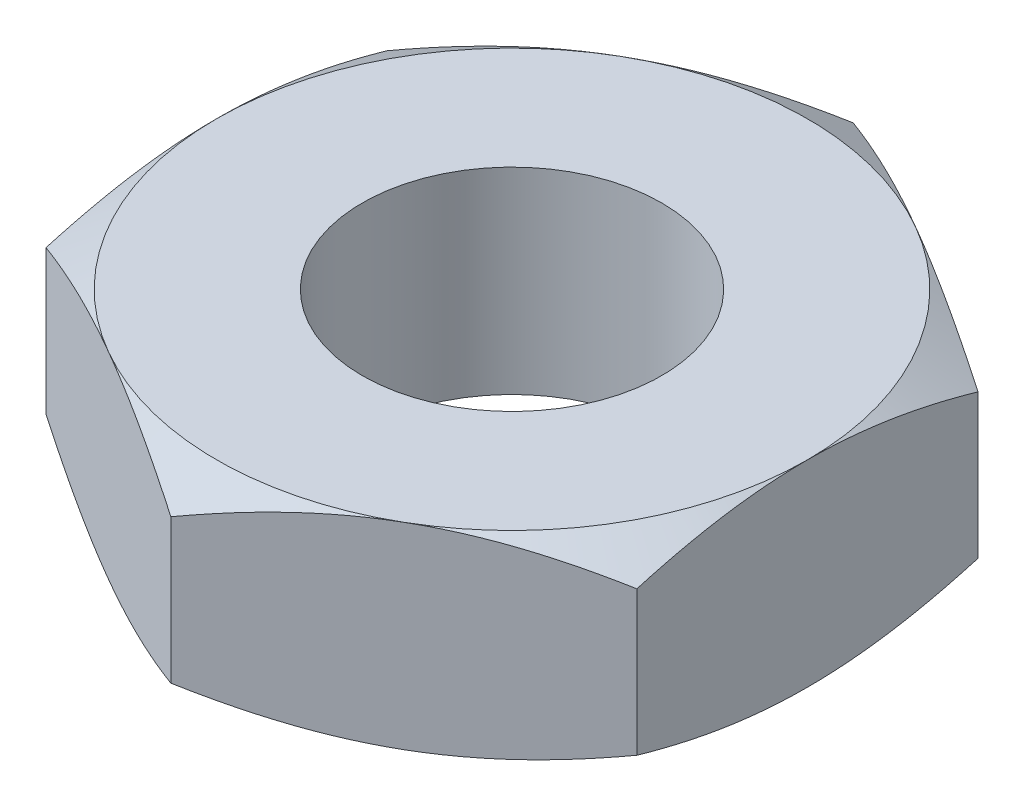
ISO-10303-21;
HEADER;
FILE_DESCRIPTION(('STEP AP214'),'2;1');
FILE_NAME('part.step','',(''),(''),'','','');
FILE_SCHEMA(('AUTOMOTIVE_DESIGN { 1 0 10303 214 1 1 1 1 }'));
ENDSEC;
DATA;
#1=APPLICATION_CONTEXT('core data for automotive mechanical design processes');
#2=APPLICATION_PROTOCOL_DEFINITION('international standard','automotive_design',2000,#1);
#3=PRODUCT_CONTEXT('',#1,'mechanical');
#4=PRODUCT('Part','Part','',(#3));
#5=PRODUCT_RELATED_PRODUCT_CATEGORY('part','',(#4));
#6=PRODUCT_DEFINITION_FORMATION('','',#4);
#7=PRODUCT_DEFINITION_CONTEXT('part definition',#1,'design');
#8=PRODUCT_DEFINITION('design','',#6,#7);
#9=PRODUCT_DEFINITION_SHAPE('','',#8);
#10=(LENGTH_UNIT() NAMED_UNIT(*) SI_UNIT(.MILLI.,.METRE.));
#11=(NAMED_UNIT(*) PLANE_ANGLE_UNIT() SI_UNIT($,.RADIAN.));
#12=(NAMED_UNIT(*) SI_UNIT($,.STERADIAN.) SOLID_ANGLE_UNIT());
#13=UNCERTAINTY_MEASURE_WITH_UNIT(LENGTH_MEASURE(1.E-05),#10,'distance_accuracy_value','');
#14=(GEOMETRIC_REPRESENTATION_CONTEXT(3) GLOBAL_UNCERTAINTY_ASSIGNED_CONTEXT((#13)) GLOBAL_UNIT_ASSIGNED_CONTEXT((#10,
#11,#12)) REPRESENTATION_CONTEXT('',''));
#15=CARTESIAN_POINT('',(0.,0.,0.));
#16=DIRECTION('',(0.,0.,1.));
#17=DIRECTION('',(1.,0.,0.));
#18=AXIS2_PLACEMENT_3D('',#15,#16,#17);
#19=CARTESIAN_POINT('',(-4.7625,1.5875,-2.74963065701559));
#20=DIRECTION('',(0.,1.,0.));
#21=DIRECTION('',(0.,0.,1.));
#22=AXIS2_PLACEMENT_3D('',#19,#20,#21);
#23=PLANE('',#22);
#24=CARTESIAN_POINT('',(0.,1.5875,0.));
#25=DIRECTION('',(0.,1.,0.));
#26=DIRECTION('',(0.,0.,1.));
#27=AXIS2_PLACEMENT_3D('',#24,#25,#26);
#28=CIRCLE('',#27,2.413);
#29=CARTESIAN_POINT('',(0.,1.5875,2.413));
#30=VERTEX_POINT('',#29);
#31=EDGE_CURVE('E244',#30,#30,#28,.T.);
#32=ORIENTED_EDGE('',*,*,#31,.F.);
#33=EDGE_LOOP('',(#32));
#34=FACE_BOUND('',#33,.T.);
#35=CARTESIAN_POINT('',(0.,1.5875,0.));
#36=DIRECTION('',(0.,1.,0.));
#37=DIRECTION('',(0.,0.,1.));
#38=AXIS2_PLACEMENT_3D('',#35,#36,#37);
#39=CIRCLE('',#38,4.7625);
#40=CARTESIAN_POINT('',(-2.38125,1.5875,4.12444598552339));
#41=VERTEX_POINT('',#40);
#42=CARTESIAN_POINT('',(2.38125,1.5875,4.12444598552339));
#43=VERTEX_POINT('',#42);
#44=EDGE_CURVE('E303',#41,#43,#39,.T.);
#45=ORIENTED_EDGE('',*,*,#44,.T.);
#46=CARTESIAN_POINT('',(4.7625,1.5875,0.));
#47=VERTEX_POINT('',#46);
#48=EDGE_CURVE('E306',#43,#47,#39,.T.);
#49=ORIENTED_EDGE('',*,*,#48,.T.);
#50=CARTESIAN_POINT('',(2.38125,1.5875,-4.12444598552339));
#51=VERTEX_POINT('',#50);
#52=EDGE_CURVE('E313',#47,#51,#39,.T.);
#53=ORIENTED_EDGE('',*,*,#52,.T.);
#54=CARTESIAN_POINT('',(-2.38125,1.5875,-4.12444598552339));
#55=VERTEX_POINT('',#54);
#56=EDGE_CURVE('E317',#51,#55,#39,.T.);
#57=ORIENTED_EDGE('',*,*,#56,.T.);
#58=CARTESIAN_POINT('',(-4.7625,1.5875,0.));
#59=VERTEX_POINT('',#58);
#60=EDGE_CURVE('E310',#55,#59,#39,.T.);
#61=ORIENTED_EDGE('',*,*,#60,.T.);
#62=EDGE_CURVE('E305',#59,#41,#39,.T.);
#63=ORIENTED_EDGE('',*,*,#62,.T.);
#64=EDGE_LOOP('',(#45,#49,#53,#57,#61,#63));
#65=FACE_BOUND('',#64,.T.);
#66=ADVANCED_FACE('F40',(#34,#65),#23,.T.);
#67=CARTESIAN_POINT('',(0.,1.5875,-5.49926131403119));
#68=DIRECTION('',(0.5,0.,0.866025403784438));
#69=DIRECTION('',(0.866025403784439,0.,-0.5));
#70=AXIS2_PLACEMENT_3D('',#67,#68,#69);
#71=PLANE('',#70);
#72=DIRECTION('',(0.,-1.,0.));
#73=VECTOR('',#72,1.);
#74=CARTESIAN_POINT('',(0.,1.5875,-5.49926131403119));
#75=LINE('',#74,#73);
#76=CARTESIAN_POINT('',(0.,1.16213065701559,-5.49926131403119));
#77=VERTEX_POINT('',#76);
#78=CARTESIAN_POINT('',(0.,-1.1621306570156,-5.49926131403119));
#79=VERTEX_POINT('',#78);
#80=EDGE_CURVE('E241',#77,#79,#75,.T.);
#81=ORIENTED_EDGE('',*,*,#80,.T.);
#82=CARTESIAN_POINT('',(0.0001999999999996,-1.16206398824923,-5.49937678408502));
#83=CARTESIAN_POINT('',(-0.209097361613879,-1.23184638758606,-5.37853889601657));
#84=CARTESIAN_POINT('',(-0.420184848381229,-1.29531673538478,-5.25666747870888));
#85=CARTESIAN_POINT('',(-0.846014990924114,-1.40610480393128,-5.01081433128269));
#86=CARTESIAN_POINT('',(-1.060765212584,-1.4533833345702,-4.88682823299882));
#87=CARTESIAN_POINT('',(-1.48763695593353,-1.52696647463122,-4.64037371706653));
#88=CARTESIAN_POINT('',(-1.69969199849542,-1.55376120779827,-4.51794368116041));
#89=CARTESIAN_POINT('',(-2.0185205060493,-1.57778887781912,-4.33386795649884));
#90=CARTESIAN_POINT('',(-2.12486940887228,-1.58310535899069,-4.27246738882597));
#91=CARTESIAN_POINT('',(-2.33766550248998,-1.58825983656829,-4.1496095068933));
#92=CARTESIAN_POINT('',(-2.44411269014726,-1.58809800219079,-4.08815219444488));
#93=CARTESIAN_POINT('',(-2.73574948805456,-1.58011505017809,-3.91977561066751));
#94=CARTESIAN_POINT('',(-2.92084246680697,-1.56670757951211,-3.81291212955969));
#95=CARTESIAN_POINT('',(-3.28979997894137,-1.52419213715631,-3.59989441060936));
#96=CARTESIAN_POINT('',(-3.47366321541067,-1.4950696317199,-3.49374092153974));
#97=CARTESIAN_POINT('',(-3.84336411079777,-1.4222707464131,-3.28029401006835));
#98=CARTESIAN_POINT('',(-4.02915510972679,-1.37828588695335,-3.17302752682367));
#99=CARTESIAN_POINT('',(-4.39796626900832,-1.27845772006118,-2.96009430473234));
#100=CARTESIAN_POINT('',(-4.58099115345591,-1.22263786532195,-2.85442483842812));
#101=CARTESIAN_POINT('',(-4.7627,-1.16206398824924,-2.74951518696175));
#102=B_SPLINE_CURVE_WITH_KNOTS('',3,(#82,#83,#84,#85,#86,#87,#88,#89,#90,#91,#92,#93,#94,#95,
#96,#97,#98,#99,#100,#101),.UNSPECIFIED.,.F.,.F.,(4,2,2,2,2,2,2,2,2,4),(0.,0.754910190012916,
1.51163483480638,2.24963134670895,2.61827336240839,2.9869039913527,3.62867423192249,
4.27103902109236,4.92765153591996,5.58297484368455),.UNSPECIFIED.);
#103=CARTESIAN_POINT('',(-2.38125,-1.5875,-4.12444598552339));
#104=VERTEX_POINT('',#103);
#105=EDGE_CURVE('E63',#79,#104,#102,.T.);
#106=ORIENTED_EDGE('',*,*,#105,.T.);
#107=CARTESIAN_POINT('',(-4.7625,-1.16213065701584,-2.74963065701596));
#108=VERTEX_POINT('',#107);
#109=EDGE_CURVE('E199',#104,#108,#102,.T.);
#110=ORIENTED_EDGE('',*,*,#109,.T.);
#111=DIRECTION('',(0.,-1.,0.));
#112=VECTOR('',#111,1.);
#113=CARTESIAN_POINT('',(-4.7625,1.5875,-2.74963065701559));
#114=LINE('',#113,#112);
#115=CARTESIAN_POINT('',(-4.7625,1.16213065701584,-2.74963065701596));
#116=VERTEX_POINT('',#115);
#117=EDGE_CURVE('E229',#116,#108,#114,.T.);
#118=ORIENTED_EDGE('',*,*,#117,.F.);
#119=CARTESIAN_POINT('',(0.0001999999999996,1.16206398824923,-5.49937678408502));
#120=CARTESIAN_POINT('',(-0.209097361613879,1.23184638758606,-5.37853889601657));
#121=CARTESIAN_POINT('',(-0.420184848381229,1.29531673538478,-5.25666747870888));
#122=CARTESIAN_POINT('',(-0.846014990924114,1.40610480393128,-5.01081433128269));
#123=CARTESIAN_POINT('',(-1.060765212584,1.4533833345702,-4.88682823299882));
#124=CARTESIAN_POINT('',(-1.48763695593353,1.52696647463122,-4.64037371706653));
#125=CARTESIAN_POINT('',(-1.69969199849542,1.55376120779827,-4.51794368116041));
#126=CARTESIAN_POINT('',(-2.0185205060493,1.57778887781912,-4.33386795649884));
#127=CARTESIAN_POINT('',(-2.12486940887228,1.58310535899069,-4.27246738882597));
#128=CARTESIAN_POINT('',(-2.33766550248998,1.58825983656829,-4.1496095068933));
#129=CARTESIAN_POINT('',(-2.44411269014726,1.58809800219079,-4.08815219444488));
#130=CARTESIAN_POINT('',(-2.73574948805456,1.58011505017809,-3.91977561066751));
#131=CARTESIAN_POINT('',(-2.92084246680697,1.56670757951211,-3.81291212955969));
#132=CARTESIAN_POINT('',(-3.28979997894137,1.52419213715631,-3.59989441060936));
#133=CARTESIAN_POINT('',(-3.47366321541067,1.4950696317199,-3.49374092153974));
#134=CARTESIAN_POINT('',(-3.84336411079777,1.4222707464131,-3.28029401006835));
#135=CARTESIAN_POINT('',(-4.02915510972679,1.37828588695335,-3.17302752682367));
#136=CARTESIAN_POINT('',(-4.39796626900832,1.27845772006118,-2.96009430473234));
#137=CARTESIAN_POINT('',(-4.58099115345591,1.22263786532195,-2.85442483842812));
#138=CARTESIAN_POINT('',(-4.7627,1.16206398824924,-2.74951518696175));
#139=B_SPLINE_CURVE_WITH_KNOTS('',3,(#119,#120,#121,#122,#123,#124,#125,#126,#127,#128,#129,
#130,#131,#132,#133,#134,#135,#136,#137,#138),.UNSPECIFIED.,.F.,.F.,(4,2,2,2,2,2,2,2,2,4),(0.,
0.754910190012916,1.51163483480638,2.24963134670895,2.61827336240839,2.9869039913527,
3.62867423192249,4.27103902109236,4.92765153591996,5.58297484368455),.UNSPECIFIED.);
#140=EDGE_CURVE('E251',#55,#116,#139,.T.);
#141=ORIENTED_EDGE('',*,*,#140,.F.);
#142=EDGE_CURVE('E248',#77,#55,#139,.T.);
#143=ORIENTED_EDGE('',*,*,#142,.F.);
#144=EDGE_LOOP('',(#81,#106,#110,#118,#141,#143));
#145=FACE_BOUND('',#144,.T.);
#146=ADVANCED_FACE('F42',(#145),#71,.F.);
#147=CARTESIAN_POINT('',(-4.7625,1.5875,-2.74963065701559));
#148=DIRECTION('',(1.,0.,0.));
#149=DIRECTION('',(0.,0.,-1.));
#150=AXIS2_PLACEMENT_3D('',#147,#148,#149);
#151=PLANE('',#150);
#152=ORIENTED_EDGE('',*,*,#117,.T.);
#153=CARTESIAN_POINT('',(-4.7625,0.770257013165544,-7.4548521239898));
#154=CARTESIAN_POINT('',(-4.7625,0.668778985397442,-7.24622578903337));
#155=CARTESIAN_POINT('',(-4.7625,0.568254310181914,-7.03712782968786));
#156=CARTESIAN_POINT('',(-4.7625,0.369646592368284,-6.6177380617082));
#157=CARTESIAN_POINT('',(-4.7625,0.271563921658949,-6.40744607715416));
#158=CARTESIAN_POINT('',(-4.7625,0.0778965155506314,-5.98436725816567));
#159=CARTESIAN_POINT('',(-4.7625,-0.0176723057795925,-5.77157311426014));
#160=CARTESIAN_POINT('',(-4.7625,-0.20498924593665,-5.34431599221292));
#161=CARTESIAN_POINT('',(-4.7625,-0.296737540895438,-5.12985309154561));
#162=CARTESIAN_POINT('',(-4.7625,-0.478361016935955,-4.69179225545347));
#163=CARTESIAN_POINT('',(-4.7625,-0.568074002975771,-4.46812671106264));
#164=CARTESIAN_POINT('',(-4.7625,-0.740875721137596,-4.01820461956393));
#165=CARTESIAN_POINT('',(-4.7625,-0.823963719835279,-3.79194778874781));
#166=CARTESIAN_POINT('',(-4.7625,-0.981385129081092,-3.33688454784998));
#167=CARTESIAN_POINT('',(-4.7625,-1.05573566623289,-3.10808412136403));
#168=CARTESIAN_POINT('',(-4.7625,-1.19334230147415,-2.64720198091947));
#169=CARTESIAN_POINT('',(-4.7625,-1.256601820398,-2.41512130264788));
#170=CARTESIAN_POINT('',(-4.7625,-1.36870365336542,-1.94881927017634));
#171=CARTESIAN_POINT('',(-4.7625,-1.41762488879615,-1.71461724023539));
#172=CARTESIAN_POINT('',(-4.7625,-1.49832401582995,-1.24323002713357));
#173=CARTESIAN_POINT('',(-4.7625,-1.53010370357438,-1.00604515918935));
#174=CARTESIAN_POINT('',(-4.7625,-1.57357159880497,-0.533004001729928));
#175=CARTESIAN_POINT('',(-4.7625,-1.58552357672468,-0.297172563804058));
#176=CARTESIAN_POINT('',(-4.7625,-1.58902159174699,0.174665243811957));
#177=CARTESIAN_POINT('',(-4.7625,-1.58056723400705,0.410671616798595));
#178=CARTESIAN_POINT('',(-4.7625,-1.54966050368575,0.809265774825708));
#179=CARTESIAN_POINT('',(-4.7625,-1.53226948633297,0.972271485740296));
#180=CARTESIAN_POINT('',(-4.7625,-1.48879809240534,1.29712782298071));
#181=CARTESIAN_POINT('',(-4.7625,-1.46271659541175,1.45897829761826));
#182=CARTESIAN_POINT('',(-4.7625,-1.37280332461803,1.94255549863789));
#183=CARTESIAN_POINT('',(-4.7625,-1.29731742601162,2.26214156206647));
#184=CARTESIAN_POINT('',(-4.7625,-1.16591226810638,2.74020920683384));
#185=CARTESIAN_POINT('',(-4.7625,-1.11843848341741,2.90115353728781));
#186=CARTESIAN_POINT('',(-4.7625,-1.01843652418993,3.22147940602563));
#187=CARTESIAN_POINT('',(-4.7625,-0.965908312023745,3.38086093266546));
#188=CARTESIAN_POINT('',(-4.7625,-0.856650817249702,3.69811099007676));
#189=CARTESIAN_POINT('',(-4.7625,-0.799922790800242,3.85597995742478));
#190=CARTESIAN_POINT('',(-4.7625,-0.682945517134669,4.17039999289197));
#191=CARTESIAN_POINT('',(-4.7625,-0.622696341912811,4.32695108788184));
#192=CARTESIAN_POINT('',(-4.7625,-0.459891575988898,4.73837886214748));
#193=CARTESIAN_POINT('',(-4.7625,-0.354864346577244,4.99227643549507));
#194=CARTESIAN_POINT('',(-4.7625,-0.13888993301258,5.4975501128138));
#195=CARTESIAN_POINT('',(-4.7625,-0.0279421615724723,5.74892596369403));
#196=CARTESIAN_POINT('',(-4.7625,0.198506550522239,6.24970729780076));
#197=CARTESIAN_POINT('',(-4.7625,0.314008916094692,6.49911213462174));
#198=CARTESIAN_POINT('',(-4.7625,0.54851848829202,6.99627197175933));
#199=CARTESIAN_POINT('',(-4.7625,0.667525795139148,7.24402692464939));
#200=CARTESIAN_POINT('',(-4.7625,0.908470259016981,7.73855307268979));
#201=CARTESIAN_POINT('',(-4.7625,1.03041144010879,7.98532230333636));
#202=CARTESIAN_POINT('',(-4.7625,1.27650264607083,8.47775804360029));
#203=CARTESIAN_POINT('',(-4.7625,1.40065269356838,8.72342454188908));
#204=CARTESIAN_POINT('',(-4.7625,1.775705630082,9.45897003760358));
#205=CARTESIAN_POINT('',(-4.7625,2.02926097618472,9.94749600811783));
#206=CARTESIAN_POINT('',(-4.7625,2.51514691975564,10.8725547205738));
#207=CARTESIAN_POINT('',(-4.7625,2.74701832406389,11.3093298079496));
#208=CARTESIAN_POINT('',(-4.7625,3.21360447153209,12.1813890765341));
#209=CARTESIAN_POINT('',(-4.7625,3.44831937238291,12.6166731733246));
#210=CARTESIAN_POINT('',(-4.7625,3.91911738749872,13.4847177120947));
#211=CARTESIAN_POINT('',(-4.7625,4.15519382424786,13.9174817814328));
#212=CARTESIAN_POINT('',(-4.7625,4.62897456623213,14.782077070908));
#213=CARTESIAN_POINT('',(-4.7625,4.86667875094032,15.2139083570643));
#214=CARTESIAN_POINT('',(-4.7625,5.10497771910938,15.645409087316));
#215=B_SPLINE_CURVE_WITH_KNOTS('',3,(#153,#154,#155,#156,#157,#158,#159,#160,#161,#162,#163,
#164,#165,#166,#167,#168,#169,#170,#171,#172,#173,#174,#175,#176,#177,#178,#179,#180,#181,#182,
#183,#184,#185,#186,#187,#188,#189,#190,#191,#192,#193,#194,#195,#196,#197,#198,#199,#200,#201,
#202,#203,#204,#205,#206,#207,#208,#209,#210,#211,#212,#213,#214),.UNSPECIFIED.,.F.,.F.,(4,2,2,
2,2,2,2,2,2,2,2,2,2,2,2,2,2,2,2,2,2,2,2,2,2,2,2,2,2,2,4),(0.,0.696000019838075,1.39210539194011,
2.09188434508409,2.79163100157903,3.51451060833337,4.23747013123917,4.95898804575384,
5.68028302744324,6.39752987210376,7.11470154694188,7.8222537665322,8.52981967667189,
9.02137506634945,9.51299385426654,10.4967303969655,11.0000858303162,11.5034450111852,
12.006654241601,12.5098531868766,13.3340317551406,14.1582922301707,14.9828126558199,
15.8073566812024,16.6331045906138,17.4588609637488,19.110036172797,20.5935453615623,
22.0771372008863,23.5560355888417,25.0348256306885),.UNSPECIFIED.);
#216=CARTESIAN_POINT('',(-4.7625,-1.5875,0.));
#217=VERTEX_POINT('',#216);
#218=EDGE_CURVE('E284',#108,#217,#215,.T.);
#219=ORIENTED_EDGE('',*,*,#218,.T.);
#220=CARTESIAN_POINT('',(-4.7625,-1.1621306570156,2.74963065701559));
#221=VERTEX_POINT('',#220);
#222=EDGE_CURVE('E278',#217,#221,#215,.T.);
#223=ORIENTED_EDGE('',*,*,#222,.T.);
#224=DIRECTION('',(0.,-1.,0.));
#225=VECTOR('',#224,1.);
#226=CARTESIAN_POINT('',(-4.7625,1.5875,2.74963065701559));
#227=LINE('',#226,#225);
#228=CARTESIAN_POINT('',(-4.7625,1.1621306570156,2.74963065701559));
#229=VERTEX_POINT('',#228);
#230=EDGE_CURVE('E232',#229,#221,#227,.T.);
#231=ORIENTED_EDGE('',*,*,#230,.F.);
#232=CARTESIAN_POINT('',(-4.7625,-0.770257013165544,-7.4548521239898));
#233=CARTESIAN_POINT('',(-4.7625,-0.668778985397442,-7.24622578903337));
#234=CARTESIAN_POINT('',(-4.7625,-0.568254310181914,-7.03712782968786));
#235=CARTESIAN_POINT('',(-4.7625,-0.369646592368284,-6.6177380617082));
#236=CARTESIAN_POINT('',(-4.7625,-0.271563921658949,-6.40744607715416));
#237=CARTESIAN_POINT('',(-4.7625,-0.0778965155506314,-5.98436725816567));
#238=CARTESIAN_POINT('',(-4.7625,0.0176723057795925,-5.77157311426014));
#239=CARTESIAN_POINT('',(-4.7625,0.20498924593665,-5.34431599221292));
#240=CARTESIAN_POINT('',(-4.7625,0.296737540895438,-5.12985309154561));
#241=CARTESIAN_POINT('',(-4.7625,0.478361016935955,-4.69179225545347));
#242=CARTESIAN_POINT('',(-4.7625,0.568074002975771,-4.46812671106264));
#243=CARTESIAN_POINT('',(-4.7625,0.740875721137596,-4.01820461956393));
#244=CARTESIAN_POINT('',(-4.7625,0.823963719835279,-3.79194778874781));
#245=CARTESIAN_POINT('',(-4.7625,0.981385129081092,-3.33688454784998));
#246=CARTESIAN_POINT('',(-4.7625,1.05573566623289,-3.10808412136403));
#247=CARTESIAN_POINT('',(-4.7625,1.19334230147415,-2.64720198091947));
#248=CARTESIAN_POINT('',(-4.7625,1.256601820398,-2.41512130264788));
#249=CARTESIAN_POINT('',(-4.7625,1.36870365336542,-1.94881927017634));
#250=CARTESIAN_POINT('',(-4.7625,1.41762488879615,-1.71461724023539));
#251=CARTESIAN_POINT('',(-4.7625,1.49832401582995,-1.24323002713357));
#252=CARTESIAN_POINT('',(-4.7625,1.53010370357438,-1.00604515918935));
#253=CARTESIAN_POINT('',(-4.7625,1.57357159880497,-0.533004001729928));
#254=CARTESIAN_POINT('',(-4.7625,1.58552357672468,-0.297172563804058));
#255=CARTESIAN_POINT('',(-4.7625,1.58902159174699,0.174665243811957));
#256=CARTESIAN_POINT('',(-4.7625,1.58056723400705,0.410671616798595));
#257=CARTESIAN_POINT('',(-4.7625,1.54966050368575,0.809265774825708));
#258=CARTESIAN_POINT('',(-4.7625,1.53226948633297,0.972271485740296));
#259=CARTESIAN_POINT('',(-4.7625,1.48879809240534,1.29712782298071));
#260=CARTESIAN_POINT('',(-4.7625,1.46271659541175,1.45897829761826));
#261=CARTESIAN_POINT('',(-4.7625,1.37280332461803,1.94255549863789));
#262=CARTESIAN_POINT('',(-4.7625,1.29731742601162,2.26214156206647));
#263=CARTESIAN_POINT('',(-4.7625,1.16591226810638,2.74020920683384));
#264=CARTESIAN_POINT('',(-4.7625,1.11843848341741,2.90115353728781));
#265=CARTESIAN_POINT('',(-4.7625,1.01843652418993,3.22147940602563));
#266=CARTESIAN_POINT('',(-4.7625,0.965908312023745,3.38086093266546));
#267=CARTESIAN_POINT('',(-4.7625,0.856650817249702,3.69811099007676));
#268=CARTESIAN_POINT('',(-4.7625,0.799922790800242,3.85597995742478));
#269=CARTESIAN_POINT('',(-4.7625,0.682945517134669,4.17039999289197));
#270=CARTESIAN_POINT('',(-4.7625,0.622696341912811,4.32695108788184));
#271=CARTESIAN_POINT('',(-4.7625,0.459891575988898,4.73837886214748));
#272=CARTESIAN_POINT('',(-4.7625,0.354864346577244,4.99227643549507));
#273=CARTESIAN_POINT('',(-4.7625,0.13888993301258,5.4975501128138));
#274=CARTESIAN_POINT('',(-4.7625,0.0279421615724723,5.74892596369403));
#275=CARTESIAN_POINT('',(-4.7625,-0.198506550522239,6.24970729780076));
#276=CARTESIAN_POINT('',(-4.7625,-0.314008916094692,6.49911213462174));
#277=CARTESIAN_POINT('',(-4.7625,-0.54851848829202,6.99627197175933));
#278=CARTESIAN_POINT('',(-4.7625,-0.667525795139148,7.24402692464939));
#279=CARTESIAN_POINT('',(-4.7625,-0.908470259016981,7.73855307268979));
#280=CARTESIAN_POINT('',(-4.7625,-1.03041144010879,7.98532230333636));
#281=CARTESIAN_POINT('',(-4.7625,-1.27650264607083,8.47775804360029));
#282=CARTESIAN_POINT('',(-4.7625,-1.40065269356838,8.72342454188908));
#283=CARTESIAN_POINT('',(-4.7625,-1.775705630082,9.45897003760358));
#284=CARTESIAN_POINT('',(-4.7625,-2.02926097618472,9.94749600811783));
#285=CARTESIAN_POINT('',(-4.7625,-2.51514691975564,10.8725547205738));
#286=CARTESIAN_POINT('',(-4.7625,-2.74701832406389,11.3093298079496));
#287=CARTESIAN_POINT('',(-4.7625,-3.21360447153209,12.1813890765341));
#288=CARTESIAN_POINT('',(-4.7625,-3.44831937238291,12.6166731733246));
#289=CARTESIAN_POINT('',(-4.7625,-3.91911738749872,13.4847177120947));
#290=CARTESIAN_POINT('',(-4.7625,-4.15519382424786,13.9174817814328));
#291=CARTESIAN_POINT('',(-4.7625,-4.62897456623213,14.782077070908));
#292=CARTESIAN_POINT('',(-4.7625,-4.86667875094032,15.2139083570643));
#293=CARTESIAN_POINT('',(-4.7625,-5.10497771910938,15.645409087316));
#294=B_SPLINE_CURVE_WITH_KNOTS('',3,(#232,#233,#234,#235,#236,#237,#238,#239,#240,#241,#242,
#243,#244,#245,#246,#247,#248,#249,#250,#251,#252,#253,#254,#255,#256,#257,#258,#259,#260,#261,
#262,#263,#264,#265,#266,#267,#268,#269,#270,#271,#272,#273,#274,#275,#276,#277,#278,#279,#280,
#281,#282,#283,#284,#285,#286,#287,#288,#289,#290,#291,#292,#293),.UNSPECIFIED.,.F.,.F.,(4,2,2,
2,2,2,2,2,2,2,2,2,2,2,2,2,2,2,2,2,2,2,2,2,2,2,2,2,2,2,4),(0.,0.696000019838075,1.39210539194011,
2.09188434508409,2.79163100157903,3.51451060833337,4.23747013123917,4.95898804575384,
5.68028302744324,6.39752987210376,7.11470154694188,7.8222537665322,8.52981967667189,
9.02137506634945,9.51299385426654,10.4967303969655,11.0000858303162,11.5034450111852,
12.006654241601,12.5098531868766,13.3340317551406,14.1582922301707,14.9828126558199,
15.8073566812024,16.6331045906138,17.4588609637488,19.110036172797,20.5935453615623,
22.0771372008863,23.5560355888417,25.0348256306885),.UNSPECIFIED.);
#295=EDGE_CURVE('E258',#59,#229,#294,.T.);
#296=ORIENTED_EDGE('',*,*,#295,.F.);
#297=EDGE_CURVE('E257',#116,#59,#294,.T.);
#298=ORIENTED_EDGE('',*,*,#297,.F.);
#299=EDGE_LOOP('',(#152,#219,#223,#231,#296,#298));
#300=FACE_BOUND('',#299,.T.);
#301=ADVANCED_FACE('F271',(#300),#151,.F.);
#302=CARTESIAN_POINT('',(-4.7625,1.5875,2.74963065701559));
#303=DIRECTION('',(0.5,0.,-0.866025403784439));
#304=DIRECTION('',(-0.866025403784439,0.,-0.5));
#305=AXIS2_PLACEMENT_3D('',#302,#303,#304);
#306=PLANE('',#305);
#307=ORIENTED_EDGE('',*,*,#230,.T.);
#308=CARTESIAN_POINT('',(-4.7627,-1.16206398824923,2.74951518696176));
#309=CARTESIAN_POINT('',(-4.55340263838612,-1.23184638758606,2.87035307503021));
#310=CARTESIAN_POINT('',(-4.34231515161877,-1.29531673538478,2.9922244923379));
#311=CARTESIAN_POINT('',(-3.91648500907589,-1.40610480393128,3.23807763976409));
#312=CARTESIAN_POINT('',(-3.701734787416,-1.4533833345702,3.36206373804796));
#313=CARTESIAN_POINT('',(-3.27486304406647,-1.52696647463121,3.60851825398025));
#314=CARTESIAN_POINT('',(-3.06280800150459,-1.55376120779827,3.73094828988637));
#315=CARTESIAN_POINT('',(-2.7439794939507,-1.57778887781912,3.91502401454794));
#316=CARTESIAN_POINT('',(-2.63763059112772,-1.58310535899069,3.97642458222081));
#317=CARTESIAN_POINT('',(-2.42483449751002,-1.58825983656829,4.09928246415348));
#318=CARTESIAN_POINT('',(-2.31838730985274,-1.58809800219079,4.1607397766019));
#319=CARTESIAN_POINT('',(-2.02675051194544,-1.58011505017809,4.32911636037927));
#320=CARTESIAN_POINT('',(-1.84165753319303,-1.56670757951211,4.43597984148709));
#321=CARTESIAN_POINT('',(-1.47270002105863,-1.52419213715631,4.64899756043742));
#322=CARTESIAN_POINT('',(-1.28883678458933,-1.4950696317199,4.75515104950704));
#323=CARTESIAN_POINT('',(-0.919135889202231,-1.4222707464131,4.96859796097843));
#324=CARTESIAN_POINT('',(-0.733344890273211,-1.37828588695335,5.07586444422311));
#325=CARTESIAN_POINT('',(-0.364533730991677,-1.27845772006117,5.28879766631444));
#326=CARTESIAN_POINT('',(-0.18150884654409,-1.22263786532195,5.39446713261866));
#327=CARTESIAN_POINT('',(0.000200000000001657,-1.16206398824923,5.49937678408503));
#328=B_SPLINE_CURVE_WITH_KNOTS('',3,(#308,#309,#310,#311,#312,#313,#314,#315,#316,#317,#318,
#319,#320,#321,#322,#323,#324,#325,#326,#327),.UNSPECIFIED.,.F.,.F.,(4,2,2,2,2,2,2,2,2,4),(0.,
0.754910190012917,1.51163483480638,2.24963134670895,2.61827336240839,2.9869039913527,
3.6286742319225,4.27103902109237,4.92765153591996,5.58297484368455),.UNSPECIFIED.);
#329=CARTESIAN_POINT('',(-2.38125,-1.5875,4.12444598552339));
#330=VERTEX_POINT('',#329);
#331=EDGE_CURVE('E164',#221,#330,#328,.T.);
#332=ORIENTED_EDGE('',*,*,#331,.T.);
#333=CARTESIAN_POINT('',(0.,-1.16213065701559,5.49926131403119));
#334=VERTEX_POINT('',#333);
#335=EDGE_CURVE('E148',#330,#334,#328,.T.);
#336=ORIENTED_EDGE('',*,*,#335,.T.);
#337=DIRECTION('',(0.,-1.,0.));
#338=VECTOR('',#337,1.);
#339=CARTESIAN_POINT('',(0.,1.5875,5.49926131403119));
#340=LINE('',#339,#338);
#341=CARTESIAN_POINT('',(0.,1.16213065701559,5.49926131403119));
#342=VERTEX_POINT('',#341);
#343=EDGE_CURVE('E163',#342,#334,#340,.T.);
#344=ORIENTED_EDGE('',*,*,#343,.F.);
#345=CARTESIAN_POINT('',(-4.7627,1.16206398824923,2.74951518696176));
#346=CARTESIAN_POINT('',(-4.55340263838612,1.23184638758606,2.87035307503021));
#347=CARTESIAN_POINT('',(-4.34231515161877,1.29531673538478,2.9922244923379));
#348=CARTESIAN_POINT('',(-3.91648500907589,1.40610480393128,3.23807763976409));
#349=CARTESIAN_POINT('',(-3.701734787416,1.4533833345702,3.36206373804796));
#350=CARTESIAN_POINT('',(-3.27486304406647,1.52696647463121,3.60851825398025));
#351=CARTESIAN_POINT('',(-3.06280800150459,1.55376120779827,3.73094828988637));
#352=CARTESIAN_POINT('',(-2.7439794939507,1.57778887781912,3.91502401454794));
#353=CARTESIAN_POINT('',(-2.63763059112772,1.58310535899069,3.97642458222081));
#354=CARTESIAN_POINT('',(-2.42483449751002,1.58825983656829,4.09928246415348));
#355=CARTESIAN_POINT('',(-2.31838730985274,1.58809800219079,4.1607397766019));
#356=CARTESIAN_POINT('',(-2.02675051194544,1.58011505017809,4.32911636037927));
#357=CARTESIAN_POINT('',(-1.84165753319303,1.56670757951211,4.43597984148709));
#358=CARTESIAN_POINT('',(-1.47270002105863,1.52419213715631,4.64899756043742));
#359=CARTESIAN_POINT('',(-1.28883678458933,1.4950696317199,4.75515104950704));
#360=CARTESIAN_POINT('',(-0.919135889202231,1.4222707464131,4.96859796097843));
#361=CARTESIAN_POINT('',(-0.733344890273211,1.37828588695335,5.07586444422311));
#362=CARTESIAN_POINT('',(-0.364533730991677,1.27845772006117,5.28879766631444));
#363=CARTESIAN_POINT('',(-0.18150884654409,1.22263786532195,5.39446713261866));
#364=CARTESIAN_POINT('',(0.000200000000001657,1.16206398824923,5.49937678408503));
#365=B_SPLINE_CURVE_WITH_KNOTS('',3,(#345,#346,#347,#348,#349,#350,#351,#352,#353,#354,#355,
#356,#357,#358,#359,#360,#361,#362,#363,#364),.UNSPECIFIED.,.F.,.F.,(4,2,2,2,2,2,2,2,2,4),(0.,
0.754910190012917,1.51163483480638,2.24963134670895,2.61827336240839,2.9869039913527,
3.6286742319225,4.27103902109237,4.92765153591996,5.58297484368455),.UNSPECIFIED.);
#366=EDGE_CURVE('E265',#41,#342,#365,.T.);
#367=ORIENTED_EDGE('',*,*,#366,.F.);
#368=EDGE_CURVE('E264',#229,#41,#365,.T.);
#369=ORIENTED_EDGE('',*,*,#368,.F.);
#370=EDGE_LOOP('',(#307,#332,#336,#344,#367,#369));
#371=FACE_BOUND('',#370,.T.);
#372=ADVANCED_FACE('F274',(#371),#306,.F.);
#373=CARTESIAN_POINT('',(0.,1.5875,5.49926131403119));
#374=DIRECTION('',(-0.5,0.,-0.866025403784438));
#375=DIRECTION('',(-0.866025403784438,0.,0.5));
#376=AXIS2_PLACEMENT_3D('',#373,#374,#375);
#377=PLANE('',#376);
#378=ORIENTED_EDGE('',*,*,#343,.T.);
#379=CARTESIAN_POINT('',(-0.000199999999998284,-1.16206398824923,5.49937678408503));
#380=CARTESIAN_POINT('',(0.20909736161388,-1.23184638758606,5.37853889601657));
#381=CARTESIAN_POINT('',(0.42018484838123,-1.29531673538478,5.25666747870888));
#382=CARTESIAN_POINT('',(0.846014990924115,-1.40610480393128,5.01081433128269));
#383=CARTESIAN_POINT('',(1.060765212584,-1.4533833345702,4.88682823299882));
#384=CARTESIAN_POINT('',(1.48763695593353,-1.52696647463121,4.64037371706653));
#385=CARTESIAN_POINT('',(1.69969199849542,-1.55376120779827,4.51794368116041));
#386=CARTESIAN_POINT('',(2.0185205060493,-1.57778887781912,4.33386795649885));
#387=CARTESIAN_POINT('',(2.12486940887228,-1.58310535899069,4.27246738882597));
#388=CARTESIAN_POINT('',(2.33766550248998,-1.58825983656829,4.1496095068933));
#389=CARTESIAN_POINT('',(2.44411269014726,-1.58809800219079,4.08815219444488));
#390=CARTESIAN_POINT('',(2.73574948805456,-1.58011505017809,3.9197756106675));
#391=CARTESIAN_POINT('',(2.92084246680697,-1.56670757951211,3.81291212955969));
#392=CARTESIAN_POINT('',(3.28979997894137,-1.52419213715631,3.59989441060936));
#393=CARTESIAN_POINT('',(3.47366321541067,-1.4950696317199,3.49374092153974));
#394=CARTESIAN_POINT('',(3.84336411079777,-1.4222707464131,3.28029401006835));
#395=CARTESIAN_POINT('',(4.02915510972679,-1.37828588695335,3.17302752682367));
#396=CARTESIAN_POINT('',(4.39796626900832,-1.27845772006117,2.96009430473234));
#397=CARTESIAN_POINT('',(4.58099115345591,-1.22263786532195,2.85442483842812));
#398=CARTESIAN_POINT('',(4.7627,-1.16206398824924,2.74951518696175));
#399=B_SPLINE_CURVE_WITH_KNOTS('',3,(#379,#380,#381,#382,#383,#384,#385,#386,#387,#388,#389,
#390,#391,#392,#393,#394,#395,#396,#397,#398),.UNSPECIFIED.,.F.,.F.,(4,2,2,2,2,2,2,2,2,4),(0.,
0.754910190012916,1.51163483480638,2.24963134670895,2.61827336240839,2.9869039913527,
3.6286742319225,4.27103902109237,4.92765153591997,5.58297484368455),.UNSPECIFIED.);
#400=CARTESIAN_POINT('',(2.38125,-1.5875,4.12444598552339));
#401=VERTEX_POINT('',#400);
#402=EDGE_CURVE('E142',#334,#401,#399,.T.);
#403=ORIENTED_EDGE('',*,*,#402,.T.);
#404=CARTESIAN_POINT('',(4.7625,-1.1621306570156,2.74963065701559));
#405=VERTEX_POINT('',#404);
#406=EDGE_CURVE('E130',#401,#405,#399,.T.);
#407=ORIENTED_EDGE('',*,*,#406,.T.);
#408=DIRECTION('',(0.,-1.,0.));
#409=VECTOR('',#408,1.);
#410=CARTESIAN_POINT('',(4.7625,1.5875,2.74963065701559));
#411=LINE('',#410,#409);
#412=CARTESIAN_POINT('',(4.7625,1.1621306570156,2.74963065701559));
#413=VERTEX_POINT('',#412);
#414=EDGE_CURVE('E236',#413,#405,#411,.T.);
#415=ORIENTED_EDGE('',*,*,#414,.F.);
#416=CARTESIAN_POINT('',(-0.000199999999998284,1.16206398824923,5.49937678408503));
#417=CARTESIAN_POINT('',(0.20909736161388,1.23184638758606,5.37853889601657));
#418=CARTESIAN_POINT('',(0.42018484838123,1.29531673538478,5.25666747870888));
#419=CARTESIAN_POINT('',(0.846014990924115,1.40610480393128,5.01081433128269));
#420=CARTESIAN_POINT('',(1.060765212584,1.4533833345702,4.88682823299882));
#421=CARTESIAN_POINT('',(1.48763695593353,1.52696647463121,4.64037371706653));
#422=CARTESIAN_POINT('',(1.69969199849542,1.55376120779827,4.51794368116041));
#423=CARTESIAN_POINT('',(2.0185205060493,1.57778887781912,4.33386795649885));
#424=CARTESIAN_POINT('',(2.12486940887228,1.58310535899069,4.27246738882597));
#425=CARTESIAN_POINT('',(2.33766550248998,1.58825983656829,4.1496095068933));
#426=CARTESIAN_POINT('',(2.44411269014726,1.58809800219079,4.08815219444488));
#427=CARTESIAN_POINT('',(2.73574948805456,1.58011505017809,3.9197756106675));
#428=CARTESIAN_POINT('',(2.92084246680697,1.56670757951211,3.81291212955969));
#429=CARTESIAN_POINT('',(3.28979997894137,1.52419213715631,3.59989441060936));
#430=CARTESIAN_POINT('',(3.47366321541067,1.4950696317199,3.49374092153974));
#431=CARTESIAN_POINT('',(3.84336411079777,1.4222707464131,3.28029401006835));
#432=CARTESIAN_POINT('',(4.02915510972679,1.37828588695335,3.17302752682367));
#433=CARTESIAN_POINT('',(4.39796626900832,1.27845772006117,2.96009430473234));
#434=CARTESIAN_POINT('',(4.58099115345591,1.22263786532195,2.85442483842812));
#435=CARTESIAN_POINT('',(4.7627,1.16206398824924,2.74951518696175));
#436=B_SPLINE_CURVE_WITH_KNOTS('',3,(#416,#417,#418,#419,#420,#421,#422,#423,#424,#425,#426,
#427,#428,#429,#430,#431,#432,#433,#434,#435),.UNSPECIFIED.,.F.,.F.,(4,2,2,2,2,2,2,2,2,4),(0.,
0.754910190012916,1.51163483480638,2.24963134670895,2.61827336240839,2.9869039913527,
3.6286742319225,4.27103902109237,4.92765153591997,5.58297484368455),.UNSPECIFIED.);
#437=EDGE_CURVE('E335',#43,#413,#436,.T.);
#438=ORIENTED_EDGE('',*,*,#437,.F.);
#439=EDGE_CURVE('E337',#342,#43,#436,.T.);
#440=ORIENTED_EDGE('',*,*,#439,.F.);
#441=EDGE_LOOP('',(#378,#403,#407,#415,#438,#440));
#442=FACE_BOUND('',#441,.T.);
#443=ADVANCED_FACE('F160',(#442),#377,.F.);
#444=CARTESIAN_POINT('',(4.7625,1.5875,2.74963065701559));
#445=DIRECTION('',(-1.,0.,0.));
#446=DIRECTION('',(0.,0.,1.));
#447=AXIS2_PLACEMENT_3D('',#444,#445,#446);
#448=PLANE('',#447);
#449=ORIENTED_EDGE('',*,*,#414,.T.);
#450=CARTESIAN_POINT('',(4.7625,0.770257013165544,-7.45485212398981));
#451=CARTESIAN_POINT('',(4.7625,0.668778985397441,-7.24622578903337));
#452=CARTESIAN_POINT('',(4.7625,0.568254310181914,-7.03712782968787));
#453=CARTESIAN_POINT('',(4.7625,0.369646592368284,-6.6177380617082));
#454=CARTESIAN_POINT('',(4.7625,0.271563921658948,-6.40744607715416));
#455=CARTESIAN_POINT('',(4.7625,0.0778965155506305,-5.98436725816567));
#456=CARTESIAN_POINT('',(4.7625,-0.0176723057795935,-5.77157311426014));
#457=CARTESIAN_POINT('',(4.7625,-0.204989245936651,-5.34431599221292));
#458=CARTESIAN_POINT('',(4.7625,-0.296737540895439,-5.12985309154561));
#459=CARTESIAN_POINT('',(4.7625,-0.478361016935956,-4.69179225545347));
#460=CARTESIAN_POINT('',(4.7625,-0.568074002975772,-4.46812671106264));
#461=CARTESIAN_POINT('',(4.7625,-0.740875721137597,-4.01820461956393));
#462=CARTESIAN_POINT('',(4.7625,-0.82396371983528,-3.79194778874781));
#463=CARTESIAN_POINT('',(4.7625,-0.981385129081093,-3.33688454784998));
#464=CARTESIAN_POINT('',(4.7625,-1.05573566623289,-3.10808412136403));
#465=CARTESIAN_POINT('',(4.7625,-1.19334230147415,-2.64720198091947));
#466=CARTESIAN_POINT('',(4.7625,-1.256601820398,-2.41512130264788));
#467=CARTESIAN_POINT('',(4.7625,-1.36870365336542,-1.94881927017635));
#468=CARTESIAN_POINT('',(4.7625,-1.41762488879615,-1.71461724023539));
#469=CARTESIAN_POINT('',(4.7625,-1.49832401582995,-1.24323002713357));
#470=CARTESIAN_POINT('',(4.7625,-1.53010370357438,-1.00604515918935));
#471=CARTESIAN_POINT('',(4.7625,-1.57357159880497,-0.533004001729932));
#472=CARTESIAN_POINT('',(4.7625,-1.58552357672468,-0.297172563804062));
#473=CARTESIAN_POINT('',(4.7625,-1.58902159174699,0.174665243811954));
#474=CARTESIAN_POINT('',(4.7625,-1.58056723400706,0.410671616798591));
#475=CARTESIAN_POINT('',(4.7625,-1.54966050368575,0.809265774825705));
#476=CARTESIAN_POINT('',(4.7625,-1.53226948633297,0.972271485740294));
#477=CARTESIAN_POINT('',(4.7625,-1.48879809240534,1.29712782298071));
#478=CARTESIAN_POINT('',(4.7625,-1.46271659541176,1.45897829761826));
#479=CARTESIAN_POINT('',(4.7625,-1.37280332461803,1.94255549863789));
#480=CARTESIAN_POINT('',(4.7625,-1.29731742601162,2.26214156206647));
#481=CARTESIAN_POINT('',(4.7625,-1.16591226810638,2.74020920683383));
#482=CARTESIAN_POINT('',(4.7625,-1.11843848341741,2.9011535372878));
#483=CARTESIAN_POINT('',(4.7625,-1.01843652418993,3.22147940602563));
#484=CARTESIAN_POINT('',(4.7625,-0.965908312023746,3.38086093266546));
#485=CARTESIAN_POINT('',(4.7625,-0.856650817249703,3.69811099007675));
#486=CARTESIAN_POINT('',(4.7625,-0.799922790800244,3.85597995742478));
#487=CARTESIAN_POINT('',(4.7625,-0.68294551713467,4.17039999289196));
#488=CARTESIAN_POINT('',(4.7625,-0.622696341912813,4.32695108788184));
#489=CARTESIAN_POINT('',(4.7625,-0.4598915759889,4.73837886214747));
#490=CARTESIAN_POINT('',(4.7625,-0.354864346577246,4.99227643549507));
#491=CARTESIAN_POINT('',(4.7625,-0.138889933012581,5.49755011281379));
#492=CARTESIAN_POINT('',(4.7625,-0.0279421615724745,5.74892596369402));
#493=CARTESIAN_POINT('',(4.7625,0.198506550522237,6.24970729780075));
#494=CARTESIAN_POINT('',(4.7625,0.31400891609469,6.49911213462173));
#495=CARTESIAN_POINT('',(4.7625,0.548518488292018,6.99627197175933));
#496=CARTESIAN_POINT('',(4.7625,0.667525795139145,7.24402692464938));
#497=CARTESIAN_POINT('',(4.7625,0.908470259016978,7.73855307268978));
#498=CARTESIAN_POINT('',(4.7625,1.03041144010879,7.98532230333636));
#499=CARTESIAN_POINT('',(4.7625,1.27650264607083,8.47775804360028));
#500=CARTESIAN_POINT('',(4.7625,1.40065269356838,8.72342454188907));
#501=CARTESIAN_POINT('',(4.7625,1.77570563008199,9.45897003760357));
#502=CARTESIAN_POINT('',(4.7625,2.02926097618471,9.94749600811782));
#503=CARTESIAN_POINT('',(4.7625,2.51514691975563,10.8725547205738));
#504=CARTESIAN_POINT('',(4.7625,2.74701832406388,11.3093298079495));
#505=CARTESIAN_POINT('',(4.7625,3.21360447153209,12.1813890765341));
#506=CARTESIAN_POINT('',(4.7625,3.44831937238291,12.6166731733246));
#507=CARTESIAN_POINT('',(4.7625,3.91911738749873,13.4847177120947));
#508=CARTESIAN_POINT('',(4.7625,4.15519382424786,13.9174817814328));
#509=CARTESIAN_POINT('',(4.7625,4.62897456623213,14.782077070908));
#510=CARTESIAN_POINT('',(4.7625,4.86667875094032,15.2139083570643));
#511=CARTESIAN_POINT('',(4.76250000000001,5.10497771910938,15.645409087316));
#512=B_SPLINE_CURVE_WITH_KNOTS('',3,(#450,#451,#452,#453,#454,#455,#456,#457,#458,#459,#460,
#461,#462,#463,#464,#465,#466,#467,#468,#469,#470,#471,#472,#473,#474,#475,#476,#477,#478,#479,
#480,#481,#482,#483,#484,#485,#486,#487,#488,#489,#490,#491,#492,#493,#494,#495,#496,#497,#498,
#499,#500,#501,#502,#503,#504,#505,#506,#507,#508,#509,#510,#511),.UNSPECIFIED.,.F.,.F.,(4,2,2,
2,2,2,2,2,2,2,2,2,2,2,2,2,2,2,2,2,2,2,2,2,2,2,2,2,2,2,4),(0.,0.696000019838075,1.39210539194011,
2.0918843450841,2.79163100157903,3.51451060833337,4.23747013123918,4.95898804575384,
5.68028302744324,6.39752987210376,7.11470154694187,7.8222537665322,8.52981967667189,
9.02137506634945,9.51299385426654,10.4967303969655,11.0000858303162,11.5034450111852,
12.006654241601,12.5098531868766,13.3340317551406,14.1582922301706,14.9828126558199,
15.8073566812024,16.6331045906138,17.4588609637488,19.110036172797,20.5935453615623,
22.0771372008863,23.5560355888418,25.0348256306885),.UNSPECIFIED.);
#513=CARTESIAN_POINT('',(4.7625,-1.5875,0.));
#514=VERTEX_POINT('',#513);
#515=EDGE_CURVE('E137',#405,#514,#512,.F.);
#516=ORIENTED_EDGE('',*,*,#515,.T.);
#517=CARTESIAN_POINT('',(4.7625,-1.1621306570156,-2.7496306570156));
#518=VERTEX_POINT('',#517);
#519=EDGE_CURVE('E173',#514,#518,#512,.F.);
#520=ORIENTED_EDGE('',*,*,#519,.T.);
#521=DIRECTION('',(0.,-1.,0.));
#522=VECTOR('',#521,1.);
#523=CARTESIAN_POINT('',(4.7625,1.5875,-2.7496306570156));
#524=LINE('',#523,#522);
#525=CARTESIAN_POINT('',(4.7625,1.1621306570156,-2.7496306570156));
#526=VERTEX_POINT('',#525);
#527=EDGE_CURVE('E238',#526,#518,#524,.T.);
#528=ORIENTED_EDGE('',*,*,#527,.F.);
#529=CARTESIAN_POINT('',(4.7625,-0.770257013165544,-7.45485212398981));
#530=CARTESIAN_POINT('',(4.7625,-0.668778985397441,-7.24622578903337));
#531=CARTESIAN_POINT('',(4.7625,-0.568254310181914,-7.03712782968787));
#532=CARTESIAN_POINT('',(4.7625,-0.369646592368284,-6.6177380617082));
#533=CARTESIAN_POINT('',(4.7625,-0.271563921658948,-6.40744607715416));
#534=CARTESIAN_POINT('',(4.7625,-0.0778965155506305,-5.98436725816567));
#535=CARTESIAN_POINT('',(4.7625,0.0176723057795935,-5.77157311426014));
#536=CARTESIAN_POINT('',(4.7625,0.204989245936651,-5.34431599221292));
#537=CARTESIAN_POINT('',(4.7625,0.296737540895439,-5.12985309154561));
#538=CARTESIAN_POINT('',(4.7625,0.478361016935956,-4.69179225545347));
#539=CARTESIAN_POINT('',(4.7625,0.568074002975772,-4.46812671106264));
#540=CARTESIAN_POINT('',(4.7625,0.740875721137597,-4.01820461956393));
#541=CARTESIAN_POINT('',(4.7625,0.82396371983528,-3.79194778874781));
#542=CARTESIAN_POINT('',(4.7625,0.981385129081093,-3.33688454784998));
#543=CARTESIAN_POINT('',(4.7625,1.05573566623289,-3.10808412136403));
#544=CARTESIAN_POINT('',(4.7625,1.19334230147415,-2.64720198091947));
#545=CARTESIAN_POINT('',(4.7625,1.256601820398,-2.41512130264788));
#546=CARTESIAN_POINT('',(4.7625,1.36870365336542,-1.94881927017635));
#547=CARTESIAN_POINT('',(4.7625,1.41762488879615,-1.71461724023539));
#548=CARTESIAN_POINT('',(4.7625,1.49832401582995,-1.24323002713357));
#549=CARTESIAN_POINT('',(4.7625,1.53010370357438,-1.00604515918935));
#550=CARTESIAN_POINT('',(4.7625,1.57357159880497,-0.533004001729932));
#551=CARTESIAN_POINT('',(4.7625,1.58552357672468,-0.297172563804062));
#552=CARTESIAN_POINT('',(4.7625,1.58902159174699,0.174665243811954));
#553=CARTESIAN_POINT('',(4.7625,1.58056723400706,0.410671616798591));
#554=CARTESIAN_POINT('',(4.7625,1.54966050368575,0.809265774825705));
#555=CARTESIAN_POINT('',(4.7625,1.53226948633297,0.972271485740294));
#556=CARTESIAN_POINT('',(4.7625,1.48879809240534,1.29712782298071));
#557=CARTESIAN_POINT('',(4.7625,1.46271659541176,1.45897829761826));
#558=CARTESIAN_POINT('',(4.7625,1.37280332461803,1.94255549863789));
#559=CARTESIAN_POINT('',(4.7625,1.29731742601162,2.26214156206647));
#560=CARTESIAN_POINT('',(4.7625,1.16591226810638,2.74020920683383));
#561=CARTESIAN_POINT('',(4.7625,1.11843848341741,2.9011535372878));
#562=CARTESIAN_POINT('',(4.7625,1.01843652418993,3.22147940602563));
#563=CARTESIAN_POINT('',(4.7625,0.965908312023746,3.38086093266546));
#564=CARTESIAN_POINT('',(4.7625,0.856650817249703,3.69811099007675));
#565=CARTESIAN_POINT('',(4.7625,0.799922790800244,3.85597995742478));
#566=CARTESIAN_POINT('',(4.7625,0.68294551713467,4.17039999289196));
#567=CARTESIAN_POINT('',(4.7625,0.622696341912813,4.32695108788184));
#568=CARTESIAN_POINT('',(4.7625,0.4598915759889,4.73837886214747));
#569=CARTESIAN_POINT('',(4.7625,0.354864346577246,4.99227643549507));
#570=CARTESIAN_POINT('',(4.7625,0.138889933012581,5.49755011281379));
#571=CARTESIAN_POINT('',(4.7625,0.0279421615724745,5.74892596369402));
#572=CARTESIAN_POINT('',(4.7625,-0.198506550522237,6.24970729780075));
#573=CARTESIAN_POINT('',(4.7625,-0.31400891609469,6.49911213462173));
#574=CARTESIAN_POINT('',(4.7625,-0.548518488292018,6.99627197175933));
#575=CARTESIAN_POINT('',(4.7625,-0.667525795139145,7.24402692464938));
#576=CARTESIAN_POINT('',(4.7625,-0.908470259016978,7.73855307268978));
#577=CARTESIAN_POINT('',(4.7625,-1.03041144010879,7.98532230333636));
#578=CARTESIAN_POINT('',(4.7625,-1.27650264607083,8.47775804360028));
#579=CARTESIAN_POINT('',(4.7625,-1.40065269356838,8.72342454188907));
#580=CARTESIAN_POINT('',(4.7625,-1.77570563008199,9.45897003760357));
#581=CARTESIAN_POINT('',(4.7625,-2.02926097618471,9.94749600811782));
#582=CARTESIAN_POINT('',(4.7625,-2.51514691975563,10.8725547205738));
#583=CARTESIAN_POINT('',(4.7625,-2.74701832406388,11.3093298079495));
#584=CARTESIAN_POINT('',(4.7625,-3.21360447153209,12.1813890765341));
#585=CARTESIAN_POINT('',(4.7625,-3.44831937238291,12.6166731733246));
#586=CARTESIAN_POINT('',(4.7625,-3.91911738749873,13.4847177120947));
#587=CARTESIAN_POINT('',(4.7625,-4.15519382424786,13.9174817814328));
#588=CARTESIAN_POINT('',(4.7625,-4.62897456623213,14.782077070908));
#589=CARTESIAN_POINT('',(4.7625,-4.86667875094032,15.2139083570643));
#590=CARTESIAN_POINT('',(4.76250000000001,-5.10497771910938,15.645409087316));
#591=B_SPLINE_CURVE_WITH_KNOTS('',3,(#529,#530,#531,#532,#533,#534,#535,#536,#537,#538,#539,
#540,#541,#542,#543,#544,#545,#546,#547,#548,#549,#550,#551,#552,#553,#554,#555,#556,#557,#558,
#559,#560,#561,#562,#563,#564,#565,#566,#567,#568,#569,#570,#571,#572,#573,#574,#575,#576,#577,
#578,#579,#580,#581,#582,#583,#584,#585,#586,#587,#588,#589,#590),.UNSPECIFIED.,.F.,.F.,(4,2,2,
2,2,2,2,2,2,2,2,2,2,2,2,2,2,2,2,2,2,2,2,2,2,2,2,2,2,2,4),(0.,0.696000019838075,1.39210539194011,
2.0918843450841,2.79163100157903,3.51451060833337,4.23747013123918,4.95898804575384,
5.68028302744324,6.39752987210376,7.11470154694187,7.8222537665322,8.52981967667189,
9.02137506634945,9.51299385426654,10.4967303969655,11.0000858303162,11.5034450111852,
12.006654241601,12.5098531868766,13.3340317551406,14.1582922301706,14.9828126558199,
15.8073566812024,16.6331045906138,17.4588609637488,19.110036172797,20.5935453615623,
22.0771372008863,23.5560355888418,25.0348256306885),.UNSPECIFIED.);
#592=EDGE_CURVE('E312',#47,#526,#591,.F.);
#593=ORIENTED_EDGE('',*,*,#592,.F.);
#594=EDGE_CURVE('E316',#413,#47,#591,.F.);
#595=ORIENTED_EDGE('',*,*,#594,.F.);
#596=EDGE_LOOP('',(#449,#516,#520,#528,#593,#595));
#597=FACE_BOUND('',#596,.T.);
#598=ADVANCED_FACE('F218',(#597),#448,.F.);
#599=CARTESIAN_POINT('',(4.7625,1.5875,-2.7496306570156));
#600=DIRECTION('',(-0.5,0.,0.866025403784439));
#601=DIRECTION('',(0.866025403784439,0.,0.5));
#602=AXIS2_PLACEMENT_3D('',#599,#600,#601);
#603=PLANE('',#602);
#604=ORIENTED_EDGE('',*,*,#527,.T.);
#605=CARTESIAN_POINT('',(4.7627,-1.16206398824924,-2.74951518696176));
#606=CARTESIAN_POINT('',(4.55340263838612,-1.23184638758606,-2.87035307503021));
#607=CARTESIAN_POINT('',(4.34231515161877,-1.29531673538478,-2.9922244923379));
#608=CARTESIAN_POINT('',(3.91648500907588,-1.40610480393128,-3.23807763976409));
#609=CARTESIAN_POINT('',(3.70173478741599,-1.4533833345702,-3.36206373804796));
#610=CARTESIAN_POINT('',(3.27486304406647,-1.52696647463121,-3.60851825398025));
#611=CARTESIAN_POINT('',(3.06280800150458,-1.55376120779827,-3.73094828988638));
#612=CARTESIAN_POINT('',(2.7439794939507,-1.57778887781912,-3.91502401454794));
#613=CARTESIAN_POINT('',(2.63763059112771,-1.58310535899069,-3.97642458222081));
#614=CARTESIAN_POINT('',(2.42483449751002,-1.58825983656829,-4.09928246415349));
#615=CARTESIAN_POINT('',(2.31838730985274,-1.58809800219079,-4.1607397766019));
#616=CARTESIAN_POINT('',(2.02675051194544,-1.58011505017809,-4.32911636037927));
#617=CARTESIAN_POINT('',(1.84165753319303,-1.56670757951211,-4.43597984148709));
#618=CARTESIAN_POINT('',(1.47270002105863,-1.52419213715631,-4.64899756043742));
#619=CARTESIAN_POINT('',(1.28883678458933,-1.4950696317199,-4.75515104950704));
#620=CARTESIAN_POINT('',(0.919135889202231,-1.4222707464131,-4.96859796097843));
#621=CARTESIAN_POINT('',(0.733344890273212,-1.37828588695335,-5.07586444422311));
#622=CARTESIAN_POINT('',(0.364533730991678,-1.27845772006118,-5.28879766631444));
#623=CARTESIAN_POINT('',(0.181508846544091,-1.22263786532195,-5.39446713261866));
#624=CARTESIAN_POINT('',(-0.000200000000000753,-1.16206398824923,-5.49937678408502));
#625=B_SPLINE_CURVE_WITH_KNOTS('',3,(#605,#606,#607,#608,#609,#610,#611,#612,#613,#614,#615,
#616,#617,#618,#619,#620,#621,#622,#623,#624),.UNSPECIFIED.,.F.,.F.,(4,2,2,2,2,2,2,2,2,4),(0.,
0.754910190012917,1.51163483480638,2.24963134670895,2.61827336240839,2.9869039913527,
3.62867423192249,4.27103902109236,4.92765153591996,5.58297484368455),.UNSPECIFIED.);
#626=CARTESIAN_POINT('',(2.38125,-1.5875,-4.12444598552339));
#627=VERTEX_POINT('',#626);
#628=EDGE_CURVE('E213',#518,#627,#625,.T.);
#629=ORIENTED_EDGE('',*,*,#628,.T.);
#630=EDGE_CURVE('E157',#627,#79,#625,.T.);
#631=ORIENTED_EDGE('',*,*,#630,.T.);
#632=ORIENTED_EDGE('',*,*,#80,.F.);
#633=CARTESIAN_POINT('',(4.7627,1.16206398824924,-2.74951518696176));
#634=CARTESIAN_POINT('',(4.55340263838612,1.23184638758606,-2.87035307503021));
#635=CARTESIAN_POINT('',(4.34231515161877,1.29531673538478,-2.9922244923379));
#636=CARTESIAN_POINT('',(3.91648500907588,1.40610480393128,-3.23807763976409));
#637=CARTESIAN_POINT('',(3.70173478741599,1.4533833345702,-3.36206373804796));
#638=CARTESIAN_POINT('',(3.27486304406647,1.52696647463121,-3.60851825398025));
#639=CARTESIAN_POINT('',(3.06280800150458,1.55376120779827,-3.73094828988638));
#640=CARTESIAN_POINT('',(2.7439794939507,1.57778887781912,-3.91502401454794));
#641=CARTESIAN_POINT('',(2.63763059112771,1.58310535899069,-3.97642458222081));
#642=CARTESIAN_POINT('',(2.42483449751002,1.58825983656829,-4.09928246415349));
#643=CARTESIAN_POINT('',(2.31838730985274,1.58809800219079,-4.1607397766019));
#644=CARTESIAN_POINT('',(2.02675051194544,1.58011505017809,-4.32911636037927));
#645=CARTESIAN_POINT('',(1.84165753319303,1.56670757951211,-4.43597984148709));
#646=CARTESIAN_POINT('',(1.47270002105863,1.52419213715631,-4.64899756043742));
#647=CARTESIAN_POINT('',(1.28883678458933,1.4950696317199,-4.75515104950704));
#648=CARTESIAN_POINT('',(0.919135889202231,1.4222707464131,-4.96859796097843));
#649=CARTESIAN_POINT('',(0.733344890273212,1.37828588695335,-5.07586444422311));
#650=CARTESIAN_POINT('',(0.364533730991678,1.27845772006118,-5.28879766631444));
#651=CARTESIAN_POINT('',(0.181508846544091,1.22263786532195,-5.39446713261866));
#652=CARTESIAN_POINT('',(-0.000200000000000753,1.16206398824923,-5.49937678408502));
#653=B_SPLINE_CURVE_WITH_KNOTS('',3,(#633,#634,#635,#636,#637,#638,#639,#640,#641,#642,#643,
#644,#645,#646,#647,#648,#649,#650,#651,#652),.UNSPECIFIED.,.F.,.F.,(4,2,2,2,2,2,2,2,2,4),(0.,
0.754910190012917,1.51163483480638,2.24963134670895,2.61827336240839,2.9869039913527,
3.62867423192249,4.27103902109236,4.92765153591996,5.58297484368455),.UNSPECIFIED.);
#654=EDGE_CURVE('E223',#51,#77,#653,.T.);
#655=ORIENTED_EDGE('',*,*,#654,.F.);
#656=EDGE_CURVE('E152',#526,#51,#653,.T.);
#657=ORIENTED_EDGE('',*,*,#656,.F.);
#658=EDGE_LOOP('',(#604,#629,#631,#632,#655,#657));
#659=FACE_BOUND('',#658,.T.);
#660=ADVANCED_FACE('F214',(#659),#603,.F.);
#661=CARTESIAN_POINT('',(-4.7625,-1.5875,-2.74963065701559));
#662=DIRECTION('',(0.,1.,0.));
#663=DIRECTION('',(0.,0.,1.));
#664=AXIS2_PLACEMENT_3D('',#661,#662,#663);
#665=PLANE('',#664);
#666=CARTESIAN_POINT('',(0.,-1.5875,0.));
#667=DIRECTION('',(0.,1.,0.));
#668=DIRECTION('',(0.,0.,1.));
#669=AXIS2_PLACEMENT_3D('',#666,#667,#668);
#670=CIRCLE('',#669,4.7625);
#671=EDGE_CURVE('E45',#401,#330,#670,.F.);
#672=ORIENTED_EDGE('',*,*,#671,.T.);
#673=EDGE_CURVE('E12',#330,#217,#670,.F.);
#674=ORIENTED_EDGE('',*,*,#673,.T.);
#675=EDGE_CURVE('E50',#217,#104,#670,.F.);
#676=ORIENTED_EDGE('',*,*,#675,.T.);
#677=EDGE_CURVE('E294',#104,#627,#670,.F.);
#678=ORIENTED_EDGE('',*,*,#677,.T.);
#679=EDGE_CURVE('E151',#627,#514,#670,.F.);
#680=ORIENTED_EDGE('',*,*,#679,.T.);
#681=CARTESIAN_POINT('',(0.,-1.5875,0.));
#682=DIRECTION('',(0.,1.,0.));
#683=DIRECTION('',(0.,0.,1.));
#684=AXIS2_PLACEMENT_3D('',#681,#682,#683);
#685=CIRCLE('',#684,4.7625);
#686=EDGE_CURVE('E134',#401,#514,#685,.T.);
#687=ORIENTED_EDGE('',*,*,#686,.F.);
#688=EDGE_LOOP('',(#672,#674,#676,#678,#680,#687));
#689=FACE_BOUND('',#688,.T.);
#690=CARTESIAN_POINT('',(0.,-1.5875,0.));
#691=DIRECTION('',(0.,1.,0.));
#692=DIRECTION('',(0.,0.,1.));
#693=AXIS2_PLACEMENT_3D('',#690,#691,#692);
#694=CIRCLE('',#693,2.413);
#695=CARTESIAN_POINT('',(0.,-1.5875,2.413));
#696=VERTEX_POINT('',#695);
#697=EDGE_CURVE('E245',#696,#696,#694,.T.);
#698=ORIENTED_EDGE('',*,*,#697,.T.);
#699=EDGE_LOOP('',(#698));
#700=FACE_BOUND('',#699,.T.);
#701=ADVANCED_FACE('F153',(#689,#700),#665,.F.);
#702=CARTESIAN_POINT('',(0.,1.5875,0.));
#703=DIRECTION('',(0.,-1.,0.));
#704=DIRECTION('',(0.,0.,-1.));
#705=AXIS2_PLACEMENT_3D('',#702,#703,#704);
#706=CYLINDRICAL_SURFACE('',#705,2.413);
#707=ORIENTED_EDGE('',*,*,#31,.T.);
#708=EDGE_LOOP('',(#707));
#709=FACE_BOUND('',#708,.T.);
#710=ORIENTED_EDGE('',*,*,#697,.F.);
#711=EDGE_LOOP('',(#710));
#712=FACE_BOUND('',#711,.T.);
#713=ADVANCED_FACE('F351',(#709,#712),#706,.F.);
#714=CARTESIAN_POINT('',(0.,1.5875,0.));
#715=DIRECTION('',(0.,-1.,0.));
#716=DIRECTION('',(0.,0.,1.));
#717=AXIS2_PLACEMENT_3D('',#714,#715,#716);
#718=CONICAL_SURFACE('',#717,4.7625,1.0471975511966);
#719=ORIENTED_EDGE('',*,*,#142,.T.);
#720=ORIENTED_EDGE('',*,*,#56,.F.);
#721=ORIENTED_EDGE('',*,*,#654,.T.);
#722=EDGE_LOOP('',(#719,#720,#721));
#723=FACE_BOUND('',#722,.T.);
#724=ADVANCED_FACE('F193',(#723),#718,.T.);
#725=ORIENTED_EDGE('',*,*,#592,.T.);
#726=ORIENTED_EDGE('',*,*,#656,.T.);
#727=ORIENTED_EDGE('',*,*,#52,.F.);
#728=EDGE_LOOP('',(#725,#726,#727));
#729=FACE_BOUND('',#728,.T.);
#730=ADVANCED_FACE('F345',(#729),#718,.T.);
#731=ORIENTED_EDGE('',*,*,#437,.T.);
#732=ORIENTED_EDGE('',*,*,#594,.T.);
#733=ORIENTED_EDGE('',*,*,#48,.F.);
#734=EDGE_LOOP('',(#731,#732,#733));
#735=FACE_BOUND('',#734,.T.);
#736=ADVANCED_FACE('F343',(#735),#718,.T.);
#737=ORIENTED_EDGE('',*,*,#366,.T.);
#738=ORIENTED_EDGE('',*,*,#439,.T.);
#739=ORIENTED_EDGE('',*,*,#44,.F.);
#740=EDGE_LOOP('',(#737,#738,#739));
#741=FACE_BOUND('',#740,.T.);
#742=ADVANCED_FACE('F340',(#741),#718,.T.);
#743=ORIENTED_EDGE('',*,*,#295,.T.);
#744=ORIENTED_EDGE('',*,*,#368,.T.);
#745=ORIENTED_EDGE('',*,*,#62,.F.);
#746=EDGE_LOOP('',(#743,#744,#745));
#747=FACE_BOUND('',#746,.T.);
#748=ADVANCED_FACE('F405',(#747),#718,.T.);
#749=ORIENTED_EDGE('',*,*,#140,.T.);
#750=ORIENTED_EDGE('',*,*,#297,.T.);
#751=ORIENTED_EDGE('',*,*,#60,.F.);
#752=EDGE_LOOP('',(#749,#750,#751));
#753=FACE_BOUND('',#752,.T.);
#754=ADVANCED_FACE('F322',(#753),#718,.T.);
#755=CARTESIAN_POINT('',(0.,-1.5875,0.));
#756=DIRECTION('',(0.,1.,0.));
#757=DIRECTION('',(0.,0.,1.));
#758=AXIS2_PLACEMENT_3D('',#755,#756,#757);
#759=CONICAL_SURFACE('',#758,4.7625,1.0471975511966);
#760=ORIENTED_EDGE('',*,*,#671,.F.);
#761=ORIENTED_EDGE('',*,*,#402,.F.);
#762=ORIENTED_EDGE('',*,*,#335,.F.);
#763=EDGE_LOOP('',(#760,#761,#762));
#764=FACE_BOUND('',#763,.T.);
#765=ADVANCED_FACE('F146',(#764),#759,.T.);
#766=ORIENTED_EDGE('',*,*,#686,.T.);
#767=ORIENTED_EDGE('',*,*,#515,.F.);
#768=ORIENTED_EDGE('',*,*,#406,.F.);
#769=EDGE_LOOP('',(#766,#767,#768));
#770=FACE_BOUND('',#769,.T.);
#771=ADVANCED_FACE('F132',(#770),#759,.T.);
#772=ORIENTED_EDGE('',*,*,#679,.F.);
#773=ORIENTED_EDGE('',*,*,#628,.F.);
#774=ORIENTED_EDGE('',*,*,#519,.F.);
#775=EDGE_LOOP('',(#772,#773,#774));
#776=FACE_BOUND('',#775,.T.);
#777=ADVANCED_FACE('F192',(#776),#759,.T.);
#778=ORIENTED_EDGE('',*,*,#630,.F.);
#779=ORIENTED_EDGE('',*,*,#677,.F.);
#780=ORIENTED_EDGE('',*,*,#105,.F.);
#781=EDGE_LOOP('',(#778,#779,#780));
#782=FACE_BOUND('',#781,.T.);
#783=ADVANCED_FACE('F187',(#782),#759,.T.);
#784=ORIENTED_EDGE('',*,*,#675,.F.);
#785=ORIENTED_EDGE('',*,*,#218,.F.);
#786=ORIENTED_EDGE('',*,*,#109,.F.);
#787=EDGE_LOOP('',(#784,#785,#786));
#788=FACE_BOUND('',#787,.T.);
#789=ADVANCED_FACE('F191',(#788),#759,.T.);
#790=ORIENTED_EDGE('',*,*,#673,.F.);
#791=ORIENTED_EDGE('',*,*,#331,.F.);
#792=ORIENTED_EDGE('',*,*,#222,.F.);
#793=EDGE_LOOP('',(#790,#791,#792));
#794=FACE_BOUND('',#793,.T.);
#795=ADVANCED_FACE('F289',(#794),#759,.T.);
#796=CLOSED_SHELL('',(#66,#146,#301,#372,#443,#598,#660,#701,#713,#724,#730,#736,#742,#748,#754,
#765,#771,#777,#783,#789,#795));
#797=MANIFOLD_SOLID_BREP('B2',#796);
#798=ADVANCED_BREP_SHAPE_REPRESENTATION('',(#18,#797),#14);
#799=SHAPE_DEFINITION_REPRESENTATION(#9,#798);
ENDSEC;
END-ISO-10303-21;
